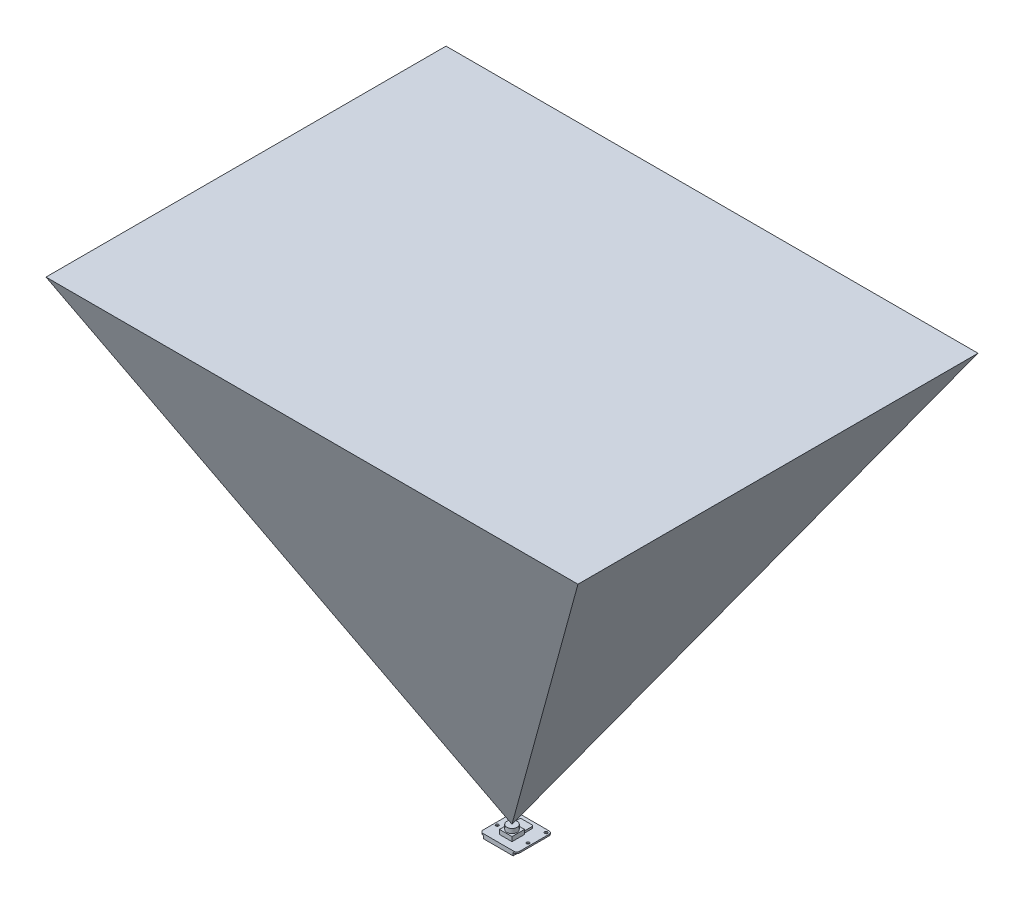
ISO-10303-21;
HEADER;
FILE_DESCRIPTION(('STEP AP214'),'2;1');
FILE_NAME('part.step','',(''),(''),'','','');
FILE_SCHEMA(('AUTOMOTIVE_DESIGN { 1 0 10303 214 1 1 1 1 }'));
ENDSEC;
DATA;
#1=APPLICATION_CONTEXT('core data for automotive mechanical design processes');
#2=APPLICATION_PROTOCOL_DEFINITION('international standard','automotive_design',2000,#1);
#3=PRODUCT_CONTEXT('',#1,'mechanical');
#4=PRODUCT('Part','Part','',(#3));
#5=PRODUCT_RELATED_PRODUCT_CATEGORY('part','',(#4));
#6=PRODUCT_DEFINITION_FORMATION('','',#4);
#7=PRODUCT_DEFINITION_CONTEXT('part definition',#1,'design');
#8=PRODUCT_DEFINITION('design','',#6,#7);
#9=PRODUCT_DEFINITION_SHAPE('','',#8);
#10=(LENGTH_UNIT() NAMED_UNIT(*) SI_UNIT(.MILLI.,.METRE.));
#11=(NAMED_UNIT(*) PLANE_ANGLE_UNIT() SI_UNIT($,.RADIAN.));
#12=(NAMED_UNIT(*) SI_UNIT($,.STERADIAN.) SOLID_ANGLE_UNIT());
#13=UNCERTAINTY_MEASURE_WITH_UNIT(LENGTH_MEASURE(1.E-05),#10,'distance_accuracy_value','');
#14=(GEOMETRIC_REPRESENTATION_CONTEXT(3) GLOBAL_UNCERTAINTY_ASSIGNED_CONTEXT((#13)) GLOBAL_UNIT_ASSIGNED_CONTEXT((#10,
#11,#12)) REPRESENTATION_CONTEXT('',''));
#15=CARTESIAN_POINT('',(0.,0.,0.));
#16=DIRECTION('',(0.,0.,1.));
#17=DIRECTION('',(1.,0.,0.));
#18=AXIS2_PLACEMENT_3D('',#15,#16,#17);
#19=CARTESIAN_POINT('',(193.471570023997,307.,200.));
#20=DIRECTION('',(-0.856267084600329,0.516533328866641,0.));
#21=DIRECTION('',(-0.516533328866641,-0.856267084600329,0.));
#22=AXIS2_PLACEMENT_3D('',#19,#20,#21);
#23=PLANE('',#22);
#24=DIRECTION('',(-0.481487702973172,-0.798171286643521,-0.36206655336201));
#25=VECTOR('',#24,1.);
#26=CARTESIAN_POINT('',(206.226287357831,328.143736552889,136.427259722615));
#27=LINE('',#26,#25);
#28=CARTESIAN_POINT('',(193.471570023997,307.,126.836035449074));
#29=VERTEX_POINT('',#28);
#30=CARTESIAN_POINT('',(12.5,7.,-9.24999999999999));
#31=VERTEX_POINT('',#30);
#32=EDGE_CURVE('E92',#29,#31,#27,.T.);
#33=ORIENTED_EDGE('',*,*,#32,.T.);
#34=DIRECTION('',(0.481487702973172,0.798171286643521,-0.36206655336201));
#35=VECTOR('',#34,1.);
#36=CARTESIAN_POINT('',(133.268934144774,207.200950009044,-100.065178599563));
#37=LINE('',#36,#35);
#38=CARTESIAN_POINT('',(193.471570023997,307.,-145.336035449074));
#39=VERTEX_POINT('',#38);
#40=EDGE_CURVE('E84',#31,#39,#37,.T.);
#41=ORIENTED_EDGE('',*,*,#40,.T.);
#42=DIRECTION('',(0.,0.,-1.));
#43=VECTOR('',#42,1.);
#44=CARTESIAN_POINT('',(193.471570023997,307.,200.));
#45=LINE('',#44,#43);
#46=EDGE_CURVE('E12',#29,#39,#45,.T.);
#47=ORIENTED_EDGE('',*,*,#46,.F.);
#48=EDGE_LOOP('',(#33,#41,#47));
#49=FACE_BOUND('',#48,.T.);
#50=ADVANCED_FACE('F54',(#49),#23,.F.);
#51=CARTESIAN_POINT('',(200.,307.,-145.336035449074));
#52=DIRECTION('',(0.,0.41310442982454,0.910683660806178));
#53=DIRECTION('',(0.,-0.910683660806178,0.41310442982454));
#54=AXIS2_PLACEMENT_3D('',#51,#52,#53);
#55=PLANE('',#54);
#56=ORIENTED_EDGE('',*,*,#40,.F.);
#57=DIRECTION('',(0.481487702973172,-0.798171286643521,0.36206655336201));
#58=VECTOR('',#57,1.);
#59=CARTESIAN_POINT('',(48.9786766065282,-53.4713932719229,18.1810405615259));
#60=LINE('',#59,#58);
#61=CARTESIAN_POINT('',(-168.471570023997,307.,-145.336035449074));
#62=VERTEX_POINT('',#61);
#63=EDGE_CURVE('E88',#62,#31,#60,.T.);
#64=ORIENTED_EDGE('',*,*,#63,.F.);
#65=DIRECTION('',(-1.,0.,0.));
#66=VECTOR('',#65,1.);
#67=CARTESIAN_POINT('',(200.,307.,-145.336035449074));
#68=LINE('',#67,#66);
#69=EDGE_CURVE('E63',#39,#62,#68,.T.);
#70=ORIENTED_EDGE('',*,*,#69,.F.);
#71=EDGE_LOOP('',(#56,#64,#70));
#72=FACE_BOUND('',#71,.T.);
#73=ADVANCED_FACE('F86',(#72),#55,.F.);
#74=CARTESIAN_POINT('',(12.5,7.,200.));
#75=DIRECTION('',(0.856267084600329,0.516533328866641,0.));
#76=DIRECTION('',(-0.516533328866641,0.856267084600329,0.));
#77=AXIS2_PLACEMENT_3D('',#74,#75,#76);
#78=PLANE('',#77);
#79=DIRECTION('',(0.,0.,-1.));
#80=VECTOR('',#79,1.);
#81=CARTESIAN_POINT('',(-168.471570023997,307.,200.));
#82=LINE('',#81,#80);
#83=CARTESIAN_POINT('',(-168.471570023997,307.,126.836035449074));
#84=VERTEX_POINT('',#83);
#85=EDGE_CURVE('E98',#84,#62,#82,.T.);
#86=ORIENTED_EDGE('',*,*,#85,.T.);
#87=ORIENTED_EDGE('',*,*,#63,.T.);
#88=DIRECTION('',(-0.481487702973172,0.798171286643521,0.36206655336201));
#89=VECTOR('',#88,1.);
#90=CARTESIAN_POINT('',(-23.9786766065282,67.4713932719229,18.1810405615259));
#91=LINE('',#90,#89);
#92=EDGE_CURVE('E58',#31,#84,#91,.T.);
#93=ORIENTED_EDGE('',*,*,#92,.T.);
#94=EDGE_LOOP('',(#86,#87,#93));
#95=FACE_BOUND('',#94,.T.);
#96=ADVANCED_FACE('F56',(#95),#78,.F.);
#97=CARTESIAN_POINT('',(200.,7.,-9.25));
#98=DIRECTION('',(0.,0.41310442982454,-0.910683660806178));
#99=DIRECTION('',(0.,0.910683660806178,0.41310442982454));
#100=AXIS2_PLACEMENT_3D('',#97,#98,#99);
#101=PLANE('',#100);
#102=ORIENTED_EDGE('',*,*,#32,.F.);
#103=DIRECTION('',(-1.,0.,0.));
#104=VECTOR('',#103,1.);
#105=CARTESIAN_POINT('',(200.,307.,126.836035449074));
#106=LINE('',#105,#104);
#107=EDGE_CURVE('E77',#29,#84,#106,.T.);
#108=ORIENTED_EDGE('',*,*,#107,.T.);
#109=ORIENTED_EDGE('',*,*,#92,.F.);
#110=EDGE_LOOP('',(#102,#108,#109));
#111=FACE_BOUND('',#110,.T.);
#112=ADVANCED_FACE('F100',(#111),#101,.F.);
#113=CARTESIAN_POINT('',(-168.471570023997,307.,200.));
#114=DIRECTION('',(0.,-1.,0.));
#115=DIRECTION('',(0.,0.,-1.));
#116=AXIS2_PLACEMENT_3D('',#113,#114,#115);
#117=PLANE('',#116);
#118=ORIENTED_EDGE('',*,*,#107,.F.);
#119=ORIENTED_EDGE('',*,*,#46,.T.);
#120=ORIENTED_EDGE('',*,*,#69,.T.);
#121=ORIENTED_EDGE('',*,*,#85,.F.);
#122=EDGE_LOOP('',(#118,#119,#120,#121));
#123=FACE_BOUND('',#122,.T.);
#124=ADVANCED_FACE('F104',(#123),#117,.F.);
#125=CLOSED_SHELL('',(#50,#73,#96,#112,#124));
#126=MANIFOLD_SOLID_BREP('B2_NOT_SHOWN',#125);
#127=CARTESIAN_POINT('',(0.,1.,0.));
#128=DIRECTION('',(0.,-1.,0.));
#129=DIRECTION('',(0.,0.,-1.));
#130=AXIS2_PLACEMENT_3D('',#127,#128,#129);
#131=PLANE('',#130);
#132=DIRECTION('',(1.,0.,0.));
#133=VECTOR('',#132,1.);
#134=CARTESIAN_POINT('',(0.,1.,0.));
#135=LINE('',#134,#133);
#136=CARTESIAN_POINT('',(2.,1.,0.));
#137=VERTEX_POINT('',#136);
#138=CARTESIAN_POINT('',(23.,1.,0.));
#139=VERTEX_POINT('',#138);
#140=EDGE_CURVE('E469',#137,#139,#135,.T.);
#141=ORIENTED_EDGE('',*,*,#140,.T.);
#142=CARTESIAN_POINT('',(23.,1.,-2.));
#143=DIRECTION('',(0.,-1.,0.));
#144=DIRECTION('',(0.,0.,-1.));
#145=AXIS2_PLACEMENT_3D('',#142,#143,#144);
#146=CIRCLE('',#145,2.);
#147=CARTESIAN_POINT('',(25.,1.,-2.));
#148=VERTEX_POINT('',#147);
#149=EDGE_CURVE('E543',#139,#148,#146,.F.);
#150=ORIENTED_EDGE('',*,*,#149,.T.);
#151=DIRECTION('',(0.,0.,-1.));
#152=VECTOR('',#151,1.);
#153=CARTESIAN_POINT('',(25.,1.,0.));
#154=LINE('',#153,#152);
#155=CARTESIAN_POINT('',(25.,1.,-22.));
#156=VERTEX_POINT('',#155);
#157=EDGE_CURVE('E474',#148,#156,#154,.T.);
#158=ORIENTED_EDGE('',*,*,#157,.T.);
#159=CARTESIAN_POINT('',(23.,1.,-22.));
#160=DIRECTION('',(0.,-1.,0.));
#161=DIRECTION('',(0.,0.,-1.));
#162=AXIS2_PLACEMENT_3D('',#159,#160,#161);
#163=CIRCLE('',#162,2.);
#164=CARTESIAN_POINT('',(23.,1.,-24.));
#165=VERTEX_POINT('',#164);
#166=EDGE_CURVE('E537',#156,#165,#163,.F.);
#167=ORIENTED_EDGE('',*,*,#166,.T.);
#168=DIRECTION('',(-1.,0.,0.));
#169=VECTOR('',#168,1.);
#170=CARTESIAN_POINT('',(0.,1.,-24.));
#171=LINE('',#170,#169);
#172=CARTESIAN_POINT('',(2.,1.,-24.));
#173=VERTEX_POINT('',#172);
#174=EDGE_CURVE('E417',#165,#173,#171,.T.);
#175=ORIENTED_EDGE('',*,*,#174,.T.);
#176=CARTESIAN_POINT('',(2.,1.,-22.));
#177=DIRECTION('',(0.,-1.,0.));
#178=DIRECTION('',(0.,0.,-1.));
#179=AXIS2_PLACEMENT_3D('',#176,#177,#178);
#180=CIRCLE('',#179,2.);
#181=CARTESIAN_POINT('',(0.,1.,-22.));
#182=VERTEX_POINT('',#181);
#183=EDGE_CURVE('E534',#173,#182,#180,.F.);
#184=ORIENTED_EDGE('',*,*,#183,.T.);
#185=DIRECTION('',(0.,0.,1.));
#186=VECTOR('',#185,1.);
#187=CARTESIAN_POINT('',(0.,1.,0.));
#188=LINE('',#187,#186);
#189=CARTESIAN_POINT('',(0.,1.,-2.));
#190=VERTEX_POINT('',#189);
#191=EDGE_CURVE('E465',#182,#190,#188,.T.);
#192=ORIENTED_EDGE('',*,*,#191,.T.);
#193=CARTESIAN_POINT('',(2.,1.,-2.));
#194=DIRECTION('',(0.,-1.,0.));
#195=DIRECTION('',(0.,0.,-1.));
#196=AXIS2_PLACEMENT_3D('',#193,#194,#195);
#197=CIRCLE('',#196,2.);
#198=EDGE_CURVE('E540',#190,#137,#197,.F.);
#199=ORIENTED_EDGE('',*,*,#198,.T.);
#200=EDGE_LOOP('',(#141,#150,#158,#167,#175,#184,#192,#199));
#201=FACE_BOUND('',#200,.T.);
#202=CARTESIAN_POINT('',(2.,1.,-9.7));
#203=DIRECTION('',(0.,1.,0.));
#204=DIRECTION('',(0.,0.,1.));
#205=AXIS2_PLACEMENT_3D('',#202,#203,#204);
#206=CIRCLE('',#205,1.);
#207=CARTESIAN_POINT('',(2.,1.,-8.7));
#208=VERTEX_POINT('',#207);
#209=EDGE_CURVE('E361',#208,#208,#206,.T.);
#210=ORIENTED_EDGE('',*,*,#209,.F.);
#211=EDGE_LOOP('',(#210));
#212=FACE_BOUND('',#211,.T.);
#213=CARTESIAN_POINT('',(2.,1.,-22.));
#214=DIRECTION('',(0.,1.,0.));
#215=DIRECTION('',(0.,0.,1.));
#216=AXIS2_PLACEMENT_3D('',#213,#214,#215);
#217=CIRCLE('',#216,1.);
#218=CARTESIAN_POINT('',(2.,1.,-21.));
#219=VERTEX_POINT('',#218);
#220=EDGE_CURVE('E357',#219,#219,#217,.T.);
#221=ORIENTED_EDGE('',*,*,#220,.F.);
#222=EDGE_LOOP('',(#221));
#223=FACE_BOUND('',#222,.T.);
#224=CARTESIAN_POINT('',(23.,1.,-22.));
#225=DIRECTION('',(0.,1.,0.));
#226=DIRECTION('',(0.,0.,1.));
#227=AXIS2_PLACEMENT_3D('',#224,#225,#226);
#228=CIRCLE('',#227,1.);
#229=CARTESIAN_POINT('',(23.,1.,-21.));
#230=VERTEX_POINT('',#229);
#231=EDGE_CURVE('E352',#230,#230,#228,.T.);
#232=ORIENTED_EDGE('',*,*,#231,.F.);
#233=EDGE_LOOP('',(#232));
#234=FACE_BOUND('',#233,.T.);
#235=CARTESIAN_POINT('',(23.,1.,-9.7));
#236=DIRECTION('',(0.,1.,0.));
#237=DIRECTION('',(0.,0.,1.));
#238=AXIS2_PLACEMENT_3D('',#235,#236,#237);
#239=CIRCLE('',#238,1.);
#240=CARTESIAN_POINT('',(23.,1.,-8.7));
#241=VERTEX_POINT('',#240);
#242=EDGE_CURVE('E346',#241,#241,#239,.T.);
#243=ORIENTED_EDGE('',*,*,#242,.F.);
#244=EDGE_LOOP('',(#243));
#245=FACE_BOUND('',#244,.T.);
#246=DIRECTION('',(0.,0.,1.));
#247=VECTOR('',#246,1.);
#248=CARTESIAN_POINT('',(9.075,1.,-16.55));
#249=LINE('',#248,#247);
#250=CARTESIAN_POINT('',(9.075,1.,-15.55));
#251=VERTEX_POINT('',#250);
#252=CARTESIAN_POINT('',(9.075,1.,-13.5));
#253=VERTEX_POINT('',#252);
#254=EDGE_CURVE('E339',#251,#253,#249,.T.);
#255=ORIENTED_EDGE('',*,*,#254,.F.);
#256=CARTESIAN_POINT('',(8.075,1.,-15.55));
#257=DIRECTION('',(0.,-1.,0.));
#258=DIRECTION('',(0.,0.,-1.));
#259=AXIS2_PLACEMENT_3D('',#256,#257,#258);
#260=CIRCLE('',#259,1.);
#261=CARTESIAN_POINT('',(8.075,1.,-16.55));
#262=VERTEX_POINT('',#261);
#263=EDGE_CURVE('E564',#251,#262,#260,.F.);
#264=ORIENTED_EDGE('',*,*,#263,.T.);
#265=CARTESIAN_POINT('',(8.075,1.,-17.55));
#266=DIRECTION('',(0.,-1.,0.));
#267=DIRECTION('',(0.,0.,-1.));
#268=AXIS2_PLACEMENT_3D('',#265,#266,#267);
#269=CIRCLE('',#268,1.);
#270=CARTESIAN_POINT('',(7.075,1.,-17.55));
#271=VERTEX_POINT('',#270);
#272=EDGE_CURVE('E593',#262,#271,#269,.T.);
#273=ORIENTED_EDGE('',*,*,#272,.T.);
#274=DIRECTION('',(0.,0.,1.));
#275=VECTOR('',#274,1.);
#276=CARTESIAN_POINT('',(7.075,1.,-20.45));
#277=LINE('',#276,#275);
#278=CARTESIAN_POINT('',(7.075,1.,-19.45));
#279=VERTEX_POINT('',#278);
#280=EDGE_CURVE('E619',#279,#271,#277,.T.);
#281=ORIENTED_EDGE('',*,*,#280,.F.);
#282=CARTESIAN_POINT('',(8.075,1.,-19.45));
#283=DIRECTION('',(0.,-1.,0.));
#284=DIRECTION('',(0.,0.,-1.));
#285=AXIS2_PLACEMENT_3D('',#282,#283,#284);
#286=CIRCLE('',#285,1.);
#287=CARTESIAN_POINT('',(8.075,1.,-20.45));
#288=VERTEX_POINT('',#287);
#289=EDGE_CURVE('E52',#279,#288,#286,.T.);
#290=ORIENTED_EDGE('',*,*,#289,.T.);
#291=DIRECTION('',(-1.,0.,0.));
#292=VECTOR('',#291,1.);
#293=CARTESIAN_POINT('',(15.925,1.,-20.45));
#294=LINE('',#293,#292);
#295=CARTESIAN_POINT('',(14.925,1.,-20.45));
#296=VERTEX_POINT('',#295);
#297=EDGE_CURVE('E601',#296,#288,#294,.T.);
#298=ORIENTED_EDGE('',*,*,#297,.F.);
#299=CARTESIAN_POINT('',(14.925,1.,-19.45));
#300=DIRECTION('',(0.,-1.,0.));
#301=DIRECTION('',(0.,0.,-1.));
#302=AXIS2_PLACEMENT_3D('',#299,#300,#301);
#303=CIRCLE('',#302,1.);
#304=CARTESIAN_POINT('',(15.925,1.,-19.45));
#305=VERTEX_POINT('',#304);
#306=EDGE_CURVE('E157',#296,#305,#303,.T.);
#307=ORIENTED_EDGE('',*,*,#306,.T.);
#308=DIRECTION('',(0.,0.,-1.));
#309=VECTOR('',#308,1.);
#310=CARTESIAN_POINT('',(15.925,1.,-13.5));
#311=LINE('',#310,#309);
#312=CARTESIAN_POINT('',(15.925,1.,-13.5));
#313=VERTEX_POINT('',#312);
#314=EDGE_CURVE('E600',#313,#305,#311,.T.);
#315=ORIENTED_EDGE('',*,*,#314,.F.);
#316=DIRECTION('',(-1.,0.,0.));
#317=VECTOR('',#316,1.);
#318=CARTESIAN_POINT('',(8.25,1.,-13.5));
#319=LINE('',#318,#317);
#320=CARTESIAN_POINT('',(16.75,1.,-13.5));
#321=VERTEX_POINT('',#320);
#322=EDGE_CURVE('E344',#321,#313,#319,.T.);
#323=ORIENTED_EDGE('',*,*,#322,.F.);
#324=DIRECTION('',(0.,0.,-1.));
#325=VECTOR('',#324,1.);
#326=CARTESIAN_POINT('',(16.75,1.,-13.5));
#327=LINE('',#326,#325);
#328=CARTESIAN_POINT('',(16.75,1.,-5.));
#329=VERTEX_POINT('',#328);
#330=EDGE_CURVE('E443',#329,#321,#327,.T.);
#331=ORIENTED_EDGE('',*,*,#330,.F.);
#332=DIRECTION('',(1.,0.,0.));
#333=VECTOR('',#332,1.);
#334=CARTESIAN_POINT('',(8.25,1.,-5.));
#335=LINE('',#334,#333);
#336=CARTESIAN_POINT('',(8.25,1.,-5.));
#337=VERTEX_POINT('',#336);
#338=EDGE_CURVE('E439',#337,#329,#335,.T.);
#339=ORIENTED_EDGE('',*,*,#338,.F.);
#340=DIRECTION('',(0.,0.,1.));
#341=VECTOR('',#340,1.);
#342=CARTESIAN_POINT('',(8.25,1.,-13.5));
#343=LINE('',#342,#341);
#344=CARTESIAN_POINT('',(8.25,1.,-13.5));
#345=VERTEX_POINT('',#344);
#346=EDGE_CURVE('E421',#345,#337,#343,.T.);
#347=ORIENTED_EDGE('',*,*,#346,.F.);
#348=EDGE_CURVE('E447',#253,#345,#319,.T.);
#349=ORIENTED_EDGE('',*,*,#348,.F.);
#350=EDGE_LOOP('',(#255,#264,#273,#281,#290,#298,#307,#315,#323,#331,#339,#347,#349));
#351=FACE_BOUND('',#350,.T.);
#352=ADVANCED_FACE('F147',(#201,#212,#223,#234,#245,#351),#131,.F.);
#353=CARTESIAN_POINT('',(8.25,4.,-13.5));
#354=DIRECTION('',(0.,0.,1.));
#355=DIRECTION('',(1.,0.,0.));
#356=AXIS2_PLACEMENT_3D('',#353,#354,#355);
#357=PLANE('',#356);
#358=DIRECTION('',(0.,-1.,0.));
#359=VECTOR('',#358,1.);
#360=CARTESIAN_POINT('',(15.925,2.3,-13.5));
#361=LINE('',#360,#359);
#362=CARTESIAN_POINT('',(15.925,2.3,-13.5));
#363=VERTEX_POINT('',#362);
#364=EDGE_CURVE('E322',#363,#313,#361,.T.);
#365=ORIENTED_EDGE('',*,*,#364,.F.);
#366=DIRECTION('',(1.,0.,0.));
#367=VECTOR('',#366,1.);
#368=CARTESIAN_POINT('',(9.075,2.3,-13.5));
#369=LINE('',#368,#367);
#370=CARTESIAN_POINT('',(9.075,2.3,-13.5));
#371=VERTEX_POINT('',#370);
#372=EDGE_CURVE('E329',#371,#363,#369,.T.);
#373=ORIENTED_EDGE('',*,*,#372,.F.);
#374=DIRECTION('',(0.,-1.,0.));
#375=VECTOR('',#374,1.);
#376=CARTESIAN_POINT('',(9.075,2.3,-13.5));
#377=LINE('',#376,#375);
#378=EDGE_CURVE('E347',#371,#253,#377,.T.);
#379=ORIENTED_EDGE('',*,*,#378,.T.);
#380=ORIENTED_EDGE('',*,*,#348,.T.);
#381=DIRECTION('',(0.,-1.,0.));
#382=VECTOR('',#381,1.);
#383=CARTESIAN_POINT('',(8.25,4.,-13.5));
#384=LINE('',#383,#382);
#385=CARTESIAN_POINT('',(8.25,4.,-13.5));
#386=VERTEX_POINT('',#385);
#387=EDGE_CURVE('E435',#386,#345,#384,.T.);
#388=ORIENTED_EDGE('',*,*,#387,.F.);
#389=DIRECTION('',(-1.,0.,0.));
#390=VECTOR('',#389,1.);
#391=CARTESIAN_POINT('',(8.25,4.,-13.5));
#392=LINE('',#391,#390);
#393=CARTESIAN_POINT('',(16.75,4.,-13.5));
#394=VERTEX_POINT('',#393);
#395=EDGE_CURVE('E432',#394,#386,#392,.T.);
#396=ORIENTED_EDGE('',*,*,#395,.F.);
#397=DIRECTION('',(0.,-1.,0.));
#398=VECTOR('',#397,1.);
#399=CARTESIAN_POINT('',(16.75,4.,-13.5));
#400=LINE('',#399,#398);
#401=EDGE_CURVE('E453',#394,#321,#400,.T.);
#402=ORIENTED_EDGE('',*,*,#401,.T.);
#403=ORIENTED_EDGE('',*,*,#322,.T.);
#404=EDGE_LOOP('',(#365,#373,#379,#380,#388,#396,#402,#403));
#405=FACE_BOUND('',#404,.T.);
#406=ADVANCED_FACE('F342',(#405),#357,.F.);
#407=CARTESIAN_POINT('',(0.,1.,0.));
#408=DIRECTION('',(1.,0.,0.));
#409=DIRECTION('',(0.,0.,-1.));
#410=AXIS2_PLACEMENT_3D('',#407,#408,#409);
#411=PLANE('',#410);
#412=DIRECTION('',(0.,0.,1.));
#413=VECTOR('',#412,1.);
#414=CARTESIAN_POINT('',(0.,0.,0.));
#415=LINE('',#414,#413);
#416=CARTESIAN_POINT('',(0.,0.,-22.));
#417=VERTEX_POINT('',#416);
#418=CARTESIAN_POINT('',(0.,0.,-2.));
#419=VERTEX_POINT('',#418);
#420=EDGE_CURVE('E464',#417,#419,#415,.T.);
#421=ORIENTED_EDGE('',*,*,#420,.T.);
#422=DIRECTION('',(0.,-1.,0.));
#423=VECTOR('',#422,1.);
#424=CARTESIAN_POINT('',(0.,1.,-2.));
#425=LINE('',#424,#423);
#426=EDGE_CURVE('E550',#419,#190,#425,.F.);
#427=ORIENTED_EDGE('',*,*,#426,.T.);
#428=ORIENTED_EDGE('',*,*,#191,.F.);
#429=DIRECTION('',(0.,-1.,0.));
#430=VECTOR('',#429,1.);
#431=CARTESIAN_POINT('',(0.,1.,-22.));
#432=LINE('',#431,#430);
#433=EDGE_CURVE('E546',#182,#417,#432,.T.);
#434=ORIENTED_EDGE('',*,*,#433,.T.);
#435=EDGE_LOOP('',(#421,#427,#428,#434));
#436=FACE_BOUND('',#435,.T.);
#437=ADVANCED_FACE('F666',(#436),#411,.F.);
#438=CARTESIAN_POINT('',(0.,1.,0.));
#439=DIRECTION('',(0.,0.,-1.));
#440=DIRECTION('',(-1.,0.,0.));
#441=AXIS2_PLACEMENT_3D('',#438,#439,#440);
#442=PLANE('',#441);
#443=DIRECTION('',(1.,0.,0.));
#444=VECTOR('',#443,1.);
#445=CARTESIAN_POINT('',(0.,0.,0.));
#446=LINE('',#445,#444);
#447=CARTESIAN_POINT('',(22.5,0.,0.));
#448=VERTEX_POINT('',#447);
#449=CARTESIAN_POINT('',(23.,0.,0.));
#450=VERTEX_POINT('',#449);
#451=EDGE_CURVE('E484',#448,#450,#446,.T.);
#452=ORIENTED_EDGE('',*,*,#451,.T.);
#453=DIRECTION('',(0.,-1.,0.));
#454=VECTOR('',#453,1.);
#455=CARTESIAN_POINT('',(23.,1.,0.));
#456=LINE('',#455,#454);
#457=EDGE_CURVE('E531',#450,#139,#456,.F.);
#458=ORIENTED_EDGE('',*,*,#457,.T.);
#459=ORIENTED_EDGE('',*,*,#140,.F.);
#460=DIRECTION('',(0.,-1.,0.));
#461=VECTOR('',#460,1.);
#462=CARTESIAN_POINT('',(2.,1.,0.));
#463=LINE('',#462,#461);
#464=CARTESIAN_POINT('',(2.,0.,0.));
#465=VERTEX_POINT('',#464);
#466=EDGE_CURVE('E527',#137,#465,#463,.T.);
#467=ORIENTED_EDGE('',*,*,#466,.T.);
#468=CARTESIAN_POINT('',(2.5,0.,0.));
#469=VERTEX_POINT('',#468);
#470=EDGE_CURVE('E485',#465,#469,#446,.T.);
#471=ORIENTED_EDGE('',*,*,#470,.T.);
#472=DIRECTION('',(0.,1.,0.));
#473=VECTOR('',#472,1.);
#474=CARTESIAN_POINT('',(2.5,-2.,0.));
#475=LINE('',#474,#473);
#476=CARTESIAN_POINT('',(2.5,-2.,0.));
#477=VERTEX_POINT('',#476);
#478=EDGE_CURVE('E383',#477,#469,#475,.T.);
#479=ORIENTED_EDGE('',*,*,#478,.F.);
#480=DIRECTION('',(-1.,0.,0.));
#481=VECTOR('',#480,1.);
#482=CARTESIAN_POINT('',(2.5,-2.,0.));
#483=LINE('',#482,#481);
#484=CARTESIAN_POINT('',(22.5,-2.,0.));
#485=VERTEX_POINT('',#484);
#486=EDGE_CURVE('E380',#485,#477,#483,.T.);
#487=ORIENTED_EDGE('',*,*,#486,.F.);
#488=DIRECTION('',(0.,1.,0.));
#489=VECTOR('',#488,1.);
#490=CARTESIAN_POINT('',(22.5,-2.,0.));
#491=LINE('',#490,#489);
#492=EDGE_CURVE('E399',#485,#448,#491,.T.);
#493=ORIENTED_EDGE('',*,*,#492,.T.);
#494=EDGE_LOOP('',(#452,#458,#459,#467,#471,#479,#487,#493));
#495=FACE_BOUND('',#494,.T.);
#496=ADVANCED_FACE('F634',(#495),#442,.F.);
#497=CARTESIAN_POINT('',(25.,1.,0.));
#498=DIRECTION('',(-1.,0.,0.));
#499=DIRECTION('',(0.,0.,1.));
#500=AXIS2_PLACEMENT_3D('',#497,#498,#499);
#501=PLANE('',#500);
#502=ORIENTED_EDGE('',*,*,#157,.F.);
#503=DIRECTION('',(0.,-1.,0.));
#504=VECTOR('',#503,1.);
#505=CARTESIAN_POINT('',(25.,1.,-2.));
#506=LINE('',#505,#504);
#507=CARTESIAN_POINT('',(25.,0.,-2.));
#508=VERTEX_POINT('',#507);
#509=EDGE_CURVE('E511',#148,#508,#506,.T.);
#510=ORIENTED_EDGE('',*,*,#509,.T.);
#511=DIRECTION('',(0.,0.,-1.));
#512=VECTOR('',#511,1.);
#513=CARTESIAN_POINT('',(25.,0.,0.));
#514=LINE('',#513,#512);
#515=CARTESIAN_POINT('',(25.,0.,-22.));
#516=VERTEX_POINT('',#515);
#517=EDGE_CURVE('E488',#508,#516,#514,.T.);
#518=ORIENTED_EDGE('',*,*,#517,.T.);
#519=DIRECTION('',(0.,-1.,0.));
#520=VECTOR('',#519,1.);
#521=CARTESIAN_POINT('',(25.,1.,-22.));
#522=LINE('',#521,#520);
#523=EDGE_CURVE('E416',#516,#156,#522,.F.);
#524=ORIENTED_EDGE('',*,*,#523,.T.);
#525=EDGE_LOOP('',(#502,#510,#518,#524));
#526=FACE_BOUND('',#525,.T.);
#527=ADVANCED_FACE('F648',(#526),#501,.F.);
#528=CARTESIAN_POINT('',(0.,1.,-24.));
#529=DIRECTION('',(0.,0.,1.));
#530=DIRECTION('',(1.,0.,0.));
#531=AXIS2_PLACEMENT_3D('',#528,#529,#530);
#532=PLANE('',#531);
#533=ORIENTED_EDGE('',*,*,#174,.F.);
#534=DIRECTION('',(0.,-1.,0.));
#535=VECTOR('',#534,1.);
#536=CARTESIAN_POINT('',(23.,1.,-24.));
#537=LINE('',#536,#535);
#538=CARTESIAN_POINT('',(23.,0.,-24.));
#539=VERTEX_POINT('',#538);
#540=EDGE_CURVE('E556',#165,#539,#537,.T.);
#541=ORIENTED_EDGE('',*,*,#540,.T.);
#542=DIRECTION('',(-1.,0.,0.));
#543=VECTOR('',#542,1.);
#544=CARTESIAN_POINT('',(0.,0.,-24.));
#545=LINE('',#544,#543);
#546=CARTESIAN_POINT('',(2.,0.,-24.));
#547=VERTEX_POINT('',#546);
#548=EDGE_CURVE('E470',#539,#547,#545,.T.);
#549=ORIENTED_EDGE('',*,*,#548,.T.);
#550=DIRECTION('',(0.,-1.,0.));
#551=VECTOR('',#550,1.);
#552=CARTESIAN_POINT('',(2.,1.,-24.));
#553=LINE('',#552,#551);
#554=EDGE_CURVE('E553',#547,#173,#553,.F.);
#555=ORIENTED_EDGE('',*,*,#554,.T.);
#556=EDGE_LOOP('',(#533,#541,#549,#555));
#557=FACE_BOUND('',#556,.T.);
#558=ADVANCED_FACE('F657',(#557),#532,.F.);
#559=CARTESIAN_POINT('',(0.,0.,0.));
#560=DIRECTION('',(0.,-1.,0.));
#561=DIRECTION('',(0.,0.,-1.));
#562=AXIS2_PLACEMENT_3D('',#559,#560,#561);
#563=PLANE('',#562);
#564=CARTESIAN_POINT('',(23.,0.,-9.7));
#565=DIRECTION('',(0.,-1.,0.));
#566=DIRECTION('',(0.,0.,-1.));
#567=AXIS2_PLACEMENT_3D('',#564,#565,#566);
#568=CIRCLE('',#567,1.);
#569=CARTESIAN_POINT('',(23.,0.,-10.7));
#570=VERTEX_POINT('',#569);
#571=EDGE_CURVE('E389',#570,#570,#568,.T.);
#572=ORIENTED_EDGE('',*,*,#571,.F.);
#573=EDGE_LOOP('',(#572));
#574=FACE_BOUND('',#573,.T.);
#575=CARTESIAN_POINT('',(23.,0.,-22.));
#576=DIRECTION('',(0.,-1.,0.));
#577=DIRECTION('',(0.,0.,-1.));
#578=AXIS2_PLACEMENT_3D('',#575,#576,#577);
#579=CIRCLE('',#578,1.);
#580=CARTESIAN_POINT('',(23.,0.,-23.));
#581=VERTEX_POINT('',#580);
#582=EDGE_CURVE('E502',#581,#581,#579,.T.);
#583=ORIENTED_EDGE('',*,*,#582,.F.);
#584=EDGE_LOOP('',(#583));
#585=FACE_BOUND('',#584,.T.);
#586=CARTESIAN_POINT('',(2.,0.,-22.));
#587=DIRECTION('',(0.,-1.,0.));
#588=DIRECTION('',(0.,0.,-1.));
#589=AXIS2_PLACEMENT_3D('',#586,#587,#588);
#590=CIRCLE('',#589,1.);
#591=CARTESIAN_POINT('',(2.,0.,-23.));
#592=VERTEX_POINT('',#591);
#593=EDGE_CURVE('E498',#592,#592,#590,.T.);
#594=ORIENTED_EDGE('',*,*,#593,.F.);
#595=EDGE_LOOP('',(#594));
#596=FACE_BOUND('',#595,.T.);
#597=CARTESIAN_POINT('',(2.,0.,-9.7));
#598=DIRECTION('',(0.,-1.,0.));
#599=DIRECTION('',(0.,0.,-1.));
#600=AXIS2_PLACEMENT_3D('',#597,#598,#599);
#601=CIRCLE('',#600,1.);
#602=CARTESIAN_POINT('',(2.,0.,-10.7));
#603=VERTEX_POINT('',#602);
#604=EDGE_CURVE('E368',#603,#603,#601,.T.);
#605=ORIENTED_EDGE('',*,*,#604,.F.);
#606=EDGE_LOOP('',(#605));
#607=FACE_BOUND('',#606,.T.);
#608=ORIENTED_EDGE('',*,*,#517,.F.);
#609=CARTESIAN_POINT('',(23.,0.,-2.));
#610=DIRECTION('',(0.,-1.,0.));
#611=DIRECTION('',(0.,0.,-1.));
#612=AXIS2_PLACEMENT_3D('',#609,#610,#611);
#613=CIRCLE('',#612,2.);
#614=EDGE_CURVE('E524',#508,#450,#613,.T.);
#615=ORIENTED_EDGE('',*,*,#614,.T.);
#616=ORIENTED_EDGE('',*,*,#451,.F.);
#617=DIRECTION('',(0.,0.,1.));
#618=VECTOR('',#617,1.);
#619=CARTESIAN_POINT('',(22.5,0.,0.));
#620=LINE('',#619,#618);
#621=CARTESIAN_POINT('',(22.5,0.,-5.4));
#622=VERTEX_POINT('',#621);
#623=EDGE_CURVE('E374',#622,#448,#620,.T.);
#624=ORIENTED_EDGE('',*,*,#623,.F.);
#625=DIRECTION('',(1.,0.,0.));
#626=VECTOR('',#625,1.);
#627=CARTESIAN_POINT('',(2.5,0.,-5.4));
#628=LINE('',#627,#626);
#629=CARTESIAN_POINT('',(2.5,0.,-5.4));
#630=VERTEX_POINT('',#629);
#631=EDGE_CURVE('E388',#630,#622,#628,.T.);
#632=ORIENTED_EDGE('',*,*,#631,.F.);
#633=DIRECTION('',(0.,0.,-1.));
#634=VECTOR('',#633,1.);
#635=CARTESIAN_POINT('',(2.5,0.,0.));
#636=LINE('',#635,#634);
#637=EDGE_CURVE('E384',#469,#630,#636,.T.);
#638=ORIENTED_EDGE('',*,*,#637,.F.);
#639=ORIENTED_EDGE('',*,*,#470,.F.);
#640=CARTESIAN_POINT('',(2.,0.,-2.));
#641=DIRECTION('',(0.,-1.,0.));
#642=DIRECTION('',(0.,0.,-1.));
#643=AXIS2_PLACEMENT_3D('',#640,#641,#642);
#644=CIRCLE('',#643,2.);
#645=EDGE_CURVE('E521',#465,#419,#644,.T.);
#646=ORIENTED_EDGE('',*,*,#645,.T.);
#647=ORIENTED_EDGE('',*,*,#420,.F.);
#648=CARTESIAN_POINT('',(2.,0.,-22.));
#649=DIRECTION('',(0.,-1.,0.));
#650=DIRECTION('',(0.,0.,-1.));
#651=AXIS2_PLACEMENT_3D('',#648,#649,#650);
#652=CIRCLE('',#651,2.);
#653=EDGE_CURVE('E515',#417,#547,#652,.T.);
#654=ORIENTED_EDGE('',*,*,#653,.T.);
#655=ORIENTED_EDGE('',*,*,#548,.F.);
#656=CARTESIAN_POINT('',(23.,0.,-22.));
#657=DIRECTION('',(0.,-1.,0.));
#658=DIRECTION('',(0.,0.,-1.));
#659=AXIS2_PLACEMENT_3D('',#656,#657,#658);
#660=CIRCLE('',#659,2.);
#661=EDGE_CURVE('E518',#539,#516,#660,.T.);
#662=ORIENTED_EDGE('',*,*,#661,.T.);
#663=EDGE_LOOP('',(#608,#615,#616,#624,#632,#638,#639,#646,#647,#654,#655,#662));
#664=FACE_BOUND('',#663,.T.);
#665=ADVANCED_FACE('F675',(#574,#585,#596,#607,#664),#563,.T.);
#666=CARTESIAN_POINT('',(8.25,4.,-13.5));
#667=DIRECTION('',(1.,0.,0.));
#668=DIRECTION('',(0.,0.,-1.));
#669=AXIS2_PLACEMENT_3D('',#666,#667,#668);
#670=PLANE('',#669);
#671=ORIENTED_EDGE('',*,*,#346,.T.);
#672=DIRECTION('',(0.,-1.,0.));
#673=VECTOR('',#672,1.);
#674=CARTESIAN_POINT('',(8.25,4.,-5.));
#675=LINE('',#674,#673);
#676=CARTESIAN_POINT('',(8.25,4.,-5.));
#677=VERTEX_POINT('',#676);
#678=EDGE_CURVE('E460',#677,#337,#675,.T.);
#679=ORIENTED_EDGE('',*,*,#678,.F.);
#680=DIRECTION('',(0.,0.,1.));
#681=VECTOR('',#680,1.);
#682=CARTESIAN_POINT('',(8.25,4.,-13.5));
#683=LINE('',#682,#681);
#684=EDGE_CURVE('E422',#386,#677,#683,.T.);
#685=ORIENTED_EDGE('',*,*,#684,.F.);
#686=ORIENTED_EDGE('',*,*,#387,.T.);
#687=EDGE_LOOP('',(#671,#679,#685,#686));
#688=FACE_BOUND('',#687,.T.);
#689=ADVANCED_FACE('F705',(#688),#670,.F.);
#690=CARTESIAN_POINT('',(8.25,4.,-5.));
#691=DIRECTION('',(0.,0.,-1.));
#692=DIRECTION('',(-1.,0.,0.));
#693=AXIS2_PLACEMENT_3D('',#690,#691,#692);
#694=PLANE('',#693);
#695=ORIENTED_EDGE('',*,*,#338,.T.);
#696=DIRECTION('',(0.,-1.,0.));
#697=VECTOR('',#696,1.);
#698=CARTESIAN_POINT('',(16.75,4.,-5.));
#699=LINE('',#698,#697);
#700=CARTESIAN_POINT('',(16.75,4.,-5.));
#701=VERTEX_POINT('',#700);
#702=EDGE_CURVE('E456',#701,#329,#699,.T.);
#703=ORIENTED_EDGE('',*,*,#702,.F.);
#704=DIRECTION('',(1.,0.,0.));
#705=VECTOR('',#704,1.);
#706=CARTESIAN_POINT('',(8.25,4.,-5.));
#707=LINE('',#706,#705);
#708=EDGE_CURVE('E426',#677,#701,#707,.T.);
#709=ORIENTED_EDGE('',*,*,#708,.F.);
#710=ORIENTED_EDGE('',*,*,#678,.T.);
#711=EDGE_LOOP('',(#695,#703,#709,#710));
#712=FACE_BOUND('',#711,.T.);
#713=ADVANCED_FACE('F952',(#712),#694,.F.);
#714=CARTESIAN_POINT('',(16.75,4.,-13.5));
#715=DIRECTION('',(-1.,0.,0.));
#716=DIRECTION('',(0.,0.,1.));
#717=AXIS2_PLACEMENT_3D('',#714,#715,#716);
#718=PLANE('',#717);
#719=ORIENTED_EDGE('',*,*,#330,.T.);
#720=ORIENTED_EDGE('',*,*,#401,.F.);
#721=DIRECTION('',(0.,0.,-1.));
#722=VECTOR('',#721,1.);
#723=CARTESIAN_POINT('',(16.75,4.,-13.5));
#724=LINE('',#723,#722);
#725=EDGE_CURVE('E429',#701,#394,#724,.T.);
#726=ORIENTED_EDGE('',*,*,#725,.F.);
#727=ORIENTED_EDGE('',*,*,#702,.T.);
#728=EDGE_LOOP('',(#719,#720,#726,#727));
#729=FACE_BOUND('',#728,.T.);
#730=ADVANCED_FACE('F943',(#729),#718,.F.);
#731=CARTESIAN_POINT('',(0.,4.,0.));
#732=DIRECTION('',(0.,1.,0.));
#733=DIRECTION('',(0.,0.,1.));
#734=AXIS2_PLACEMENT_3D('',#731,#732,#733);
#735=PLANE('',#734);
#736=CARTESIAN_POINT('',(12.5,4.,-9.25));
#737=DIRECTION('',(0.,1.,0.));
#738=DIRECTION('',(0.,0.,1.));
#739=AXIS2_PLACEMENT_3D('',#736,#737,#738);
#740=CIRCLE('',#739,3.5);
#741=CARTESIAN_POINT('',(12.5,4.,-5.75));
#742=VERTEX_POINT('',#741);
#743=EDGE_CURVE('E412',#742,#742,#740,.T.);
#744=ORIENTED_EDGE('',*,*,#743,.F.);
#745=EDGE_LOOP('',(#744));
#746=FACE_BOUND('',#745,.T.);
#747=ORIENTED_EDGE('',*,*,#684,.T.);
#748=ORIENTED_EDGE('',*,*,#708,.T.);
#749=ORIENTED_EDGE('',*,*,#725,.T.);
#750=ORIENTED_EDGE('',*,*,#395,.T.);
#751=EDGE_LOOP('',(#747,#748,#749,#750));
#752=FACE_BOUND('',#751,.T.);
#753=ADVANCED_FACE('F934',(#746,#752),#735,.T.);
#754=CARTESIAN_POINT('',(12.5,22.8994949366117,-9.25));
#755=DIRECTION('',(0.,-1.,0.));
#756=DIRECTION('',(0.,0.,-1.));
#757=AXIS2_PLACEMENT_3D('',#754,#755,#756);
#758=CYLINDRICAL_SURFACE('',#757,3.5);
#759=CARTESIAN_POINT('',(12.5,7.,-9.25));
#760=DIRECTION('',(0.,-1.,0.));
#761=DIRECTION('',(0.,0.,-1.));
#762=AXIS2_PLACEMENT_3D('',#759,#760,#761);
#763=CIRCLE('',#762,3.5);
#764=CARTESIAN_POINT('',(12.5,7.,-12.75));
#765=VERTEX_POINT('',#764);
#766=EDGE_CURVE('E411',#765,#765,#763,.T.);
#767=ORIENTED_EDGE('',*,*,#766,.T.);
#768=EDGE_LOOP('',(#767));
#769=FACE_BOUND('',#768,.T.);
#770=ORIENTED_EDGE('',*,*,#743,.T.);
#771=EDGE_LOOP('',(#770));
#772=FACE_BOUND('',#771,.T.);
#773=ADVANCED_FACE('F925',(#769,#772),#758,.T.);
#774=CARTESIAN_POINT('',(0.,7.,0.));
#775=DIRECTION('',(0.,-1.,0.));
#776=DIRECTION('',(0.,0.,-1.));
#777=AXIS2_PLACEMENT_3D('',#774,#775,#776);
#778=PLANE('',#777);
#779=ORIENTED_EDGE('',*,*,#766,.F.);
#780=EDGE_LOOP('',(#779));
#781=FACE_BOUND('',#780,.T.);
#782=ADVANCED_FACE('F695',(#781),#778,.F.);
#783=CARTESIAN_POINT('',(2.5,-2.,0.));
#784=DIRECTION('',(1.,0.,0.));
#785=DIRECTION('',(0.,0.,-1.));
#786=AXIS2_PLACEMENT_3D('',#783,#784,#785);
#787=PLANE('',#786);
#788=ORIENTED_EDGE('',*,*,#637,.T.);
#789=DIRECTION('',(0.,1.,0.));
#790=VECTOR('',#789,1.);
#791=CARTESIAN_POINT('',(2.5,-2.,-5.4));
#792=LINE('',#791,#790);
#793=CARTESIAN_POINT('',(2.5,-2.,-5.4));
#794=VERTEX_POINT('',#793);
#795=EDGE_CURVE('E407',#794,#630,#792,.T.);
#796=ORIENTED_EDGE('',*,*,#795,.F.);
#797=DIRECTION('',(0.,0.,-1.));
#798=VECTOR('',#797,1.);
#799=CARTESIAN_POINT('',(2.5,-2.,0.));
#800=LINE('',#799,#798);
#801=EDGE_CURVE('E369',#477,#794,#800,.T.);
#802=ORIENTED_EDGE('',*,*,#801,.F.);
#803=ORIENTED_EDGE('',*,*,#478,.T.);
#804=EDGE_LOOP('',(#788,#796,#802,#803));
#805=FACE_BOUND('',#804,.T.);
#806=ADVANCED_FACE('F679',(#805),#787,.F.);
#807=CARTESIAN_POINT('',(2.5,-2.,-5.4));
#808=DIRECTION('',(0.,0.,1.));
#809=DIRECTION('',(1.,0.,0.));
#810=AXIS2_PLACEMENT_3D('',#807,#808,#809);
#811=PLANE('',#810);
#812=ORIENTED_EDGE('',*,*,#631,.T.);
#813=DIRECTION('',(0.,1.,0.));
#814=VECTOR('',#813,1.);
#815=CARTESIAN_POINT('',(22.5,-2.,-5.4));
#816=LINE('',#815,#814);
#817=CARTESIAN_POINT('',(22.5,-2.,-5.4));
#818=VERTEX_POINT('',#817);
#819=EDGE_CURVE('E403',#818,#622,#816,.T.);
#820=ORIENTED_EDGE('',*,*,#819,.F.);
#821=DIRECTION('',(1.,0.,0.));
#822=VECTOR('',#821,1.);
#823=CARTESIAN_POINT('',(2.5,-2.,-5.4));
#824=LINE('',#823,#822);
#825=EDGE_CURVE('E373',#794,#818,#824,.T.);
#826=ORIENTED_EDGE('',*,*,#825,.F.);
#827=ORIENTED_EDGE('',*,*,#795,.T.);
#828=EDGE_LOOP('',(#812,#820,#826,#827));
#829=FACE_BOUND('',#828,.T.);
#830=ADVANCED_FACE('F687',(#829),#811,.F.);
#831=CARTESIAN_POINT('',(22.5,-2.,0.));
#832=DIRECTION('',(-1.,0.,0.));
#833=DIRECTION('',(0.,0.,1.));
#834=AXIS2_PLACEMENT_3D('',#831,#832,#833);
#835=PLANE('',#834);
#836=ORIENTED_EDGE('',*,*,#623,.T.);
#837=ORIENTED_EDGE('',*,*,#492,.F.);
#838=DIRECTION('',(0.,0.,1.));
#839=VECTOR('',#838,1.);
#840=CARTESIAN_POINT('',(22.5,-2.,0.));
#841=LINE('',#840,#839);
#842=EDGE_CURVE('E377',#818,#485,#841,.T.);
#843=ORIENTED_EDGE('',*,*,#842,.F.);
#844=ORIENTED_EDGE('',*,*,#819,.T.);
#845=EDGE_LOOP('',(#836,#837,#843,#844));
#846=FACE_BOUND('',#845,.T.);
#847=ADVANCED_FACE('F685',(#846),#835,.F.);
#848=CARTESIAN_POINT('',(0.,-2.,0.));
#849=DIRECTION('',(0.,-1.,0.));
#850=DIRECTION('',(0.,0.,-1.));
#851=AXIS2_PLACEMENT_3D('',#848,#849,#850);
#852=PLANE('',#851);
#853=ORIENTED_EDGE('',*,*,#801,.T.);
#854=ORIENTED_EDGE('',*,*,#825,.T.);
#855=ORIENTED_EDGE('',*,*,#842,.T.);
#856=ORIENTED_EDGE('',*,*,#486,.T.);
#857=EDGE_LOOP('',(#853,#854,#855,#856));
#858=FACE_BOUND('',#857,.T.);
#859=ADVANCED_FACE('F681',(#858),#852,.T.);
#860=CARTESIAN_POINT('',(2.,-2.,-9.7));
#861=DIRECTION('',(0.,1.,0.));
#862=DIRECTION('',(0.,0.,1.));
#863=AXIS2_PLACEMENT_3D('',#860,#861,#862);
#864=CYLINDRICAL_SURFACE('',#863,1.);
#865=ORIENTED_EDGE('',*,*,#604,.T.);
#866=EDGE_LOOP('',(#865));
#867=FACE_BOUND('',#866,.T.);
#868=ORIENTED_EDGE('',*,*,#209,.T.);
#869=EDGE_LOOP('',(#868));
#870=FACE_BOUND('',#869,.T.);
#871=ADVANCED_FACE('F767',(#867,#870),#864,.F.);
#872=CARTESIAN_POINT('',(2.,-2.,-22.));
#873=DIRECTION('',(0.,1.,0.));
#874=DIRECTION('',(0.,0.,1.));
#875=AXIS2_PLACEMENT_3D('',#872,#873,#874);
#876=CYLINDRICAL_SURFACE('',#875,1.);
#877=ORIENTED_EDGE('',*,*,#593,.T.);
#878=EDGE_LOOP('',(#877));
#879=FACE_BOUND('',#878,.T.);
#880=ORIENTED_EDGE('',*,*,#220,.T.);
#881=EDGE_LOOP('',(#880));
#882=FACE_BOUND('',#881,.T.);
#883=ADVANCED_FACE('F763',(#879,#882),#876,.F.);
#884=CARTESIAN_POINT('',(23.,-2.,-22.));
#885=DIRECTION('',(0.,1.,0.));
#886=DIRECTION('',(0.,0.,1.));
#887=AXIS2_PLACEMENT_3D('',#884,#885,#886);
#888=CYLINDRICAL_SURFACE('',#887,1.);
#889=ORIENTED_EDGE('',*,*,#582,.T.);
#890=EDGE_LOOP('',(#889));
#891=FACE_BOUND('',#890,.T.);
#892=ORIENTED_EDGE('',*,*,#231,.T.);
#893=EDGE_LOOP('',(#892));
#894=FACE_BOUND('',#893,.T.);
#895=ADVANCED_FACE('F766',(#891,#894),#888,.F.);
#896=CARTESIAN_POINT('',(23.,-2.,-9.7));
#897=DIRECTION('',(0.,1.,0.));
#898=DIRECTION('',(0.,0.,1.));
#899=AXIS2_PLACEMENT_3D('',#896,#897,#898);
#900=CYLINDRICAL_SURFACE('',#899,1.);
#901=ORIENTED_EDGE('',*,*,#571,.T.);
#902=EDGE_LOOP('',(#901));
#903=FACE_BOUND('',#902,.T.);
#904=ORIENTED_EDGE('',*,*,#242,.T.);
#905=EDGE_LOOP('',(#904));
#906=FACE_BOUND('',#905,.T.);
#907=ADVANCED_FACE('F720',(#903,#906),#900,.F.);
#908=CARTESIAN_POINT('',(23.,1.,-2.));
#909=DIRECTION('',(0.,-1.,0.));
#910=DIRECTION('',(0.,0.,-1.));
#911=AXIS2_PLACEMENT_3D('',#908,#909,#910);
#912=CYLINDRICAL_SURFACE('',#911,2.);
#913=ORIENTED_EDGE('',*,*,#149,.F.);
#914=ORIENTED_EDGE('',*,*,#457,.F.);
#915=ORIENTED_EDGE('',*,*,#614,.F.);
#916=ORIENTED_EDGE('',*,*,#509,.F.);
#917=EDGE_LOOP('',(#913,#914,#915,#916));
#918=FACE_BOUND('',#917,.T.);
#919=ADVANCED_FACE('F641',(#918),#912,.T.);
#920=CARTESIAN_POINT('',(2.,1.,-2.));
#921=DIRECTION('',(0.,-1.,0.));
#922=DIRECTION('',(0.,0.,-1.));
#923=AXIS2_PLACEMENT_3D('',#920,#921,#922);
#924=CYLINDRICAL_SURFACE('',#923,2.);
#925=ORIENTED_EDGE('',*,*,#198,.F.);
#926=ORIENTED_EDGE('',*,*,#426,.F.);
#927=ORIENTED_EDGE('',*,*,#645,.F.);
#928=ORIENTED_EDGE('',*,*,#466,.F.);
#929=EDGE_LOOP('',(#925,#926,#927,#928));
#930=FACE_BOUND('',#929,.T.);
#931=ADVANCED_FACE('F670',(#930),#924,.T.);
#932=CARTESIAN_POINT('',(23.,1.,-22.));
#933=DIRECTION('',(0.,-1.,0.));
#934=DIRECTION('',(0.,0.,-1.));
#935=AXIS2_PLACEMENT_3D('',#932,#933,#934);
#936=CYLINDRICAL_SURFACE('',#935,2.);
#937=ORIENTED_EDGE('',*,*,#166,.F.);
#938=ORIENTED_EDGE('',*,*,#523,.F.);
#939=ORIENTED_EDGE('',*,*,#661,.F.);
#940=ORIENTED_EDGE('',*,*,#540,.F.);
#941=EDGE_LOOP('',(#937,#938,#939,#940));
#942=FACE_BOUND('',#941,.T.);
#943=ADVANCED_FACE('F652',(#942),#936,.T.);
#944=CARTESIAN_POINT('',(2.,1.,-22.));
#945=DIRECTION('',(0.,-1.,0.));
#946=DIRECTION('',(0.,0.,-1.));
#947=AXIS2_PLACEMENT_3D('',#944,#945,#946);
#948=CYLINDRICAL_SURFACE('',#947,2.);
#949=ORIENTED_EDGE('',*,*,#183,.F.);
#950=ORIENTED_EDGE('',*,*,#554,.F.);
#951=ORIENTED_EDGE('',*,*,#653,.F.);
#952=ORIENTED_EDGE('',*,*,#433,.F.);
#953=EDGE_LOOP('',(#949,#950,#951,#952));
#954=FACE_BOUND('',#953,.T.);
#955=ADVANCED_FACE('F661',(#954),#948,.T.);
#956=CARTESIAN_POINT('',(15.925,2.3,-13.5));
#957=DIRECTION('',(-1.,0.,0.));
#958=DIRECTION('',(0.,0.,1.));
#959=AXIS2_PLACEMENT_3D('',#956,#957,#958);
#960=PLANE('',#959);
#961=ORIENTED_EDGE('',*,*,#314,.T.);
#962=DIRECTION('',(0.,-1.,0.));
#963=VECTOR('',#962,1.);
#964=CARTESIAN_POINT('',(15.925,2.3,-19.45));
#965=LINE('',#964,#963);
#966=CARTESIAN_POINT('',(15.925,2.3,-19.45));
#967=VERTEX_POINT('',#966);
#968=EDGE_CURVE('E325',#305,#967,#965,.F.);
#969=ORIENTED_EDGE('',*,*,#968,.T.);
#970=DIRECTION('',(0.,0.,-1.));
#971=VECTOR('',#970,1.);
#972=CARTESIAN_POINT('',(15.925,2.3,-13.5));
#973=LINE('',#972,#971);
#974=EDGE_CURVE('E317',#363,#967,#973,.T.);
#975=ORIENTED_EDGE('',*,*,#974,.F.);
#976=ORIENTED_EDGE('',*,*,#364,.T.);
#977=EDGE_LOOP('',(#961,#969,#975,#976));
#978=FACE_BOUND('',#977,.T.);
#979=ADVANCED_FACE('F320',(#978),#960,.F.);
#980=CARTESIAN_POINT('',(15.925,2.3,-20.45));
#981=DIRECTION('',(0.,0.,1.));
#982=DIRECTION('',(1.,0.,0.));
#983=AXIS2_PLACEMENT_3D('',#980,#981,#982);
#984=PLANE('',#983);
#985=DIRECTION('',(-1.,0.,0.));
#986=VECTOR('',#985,1.);
#987=CARTESIAN_POINT('',(15.925,2.3,-20.45));
#988=LINE('',#987,#986);
#989=CARTESIAN_POINT('',(14.925,2.3,-20.45));
#990=VERTEX_POINT('',#989);
#991=CARTESIAN_POINT('',(8.075,2.3,-20.45));
#992=VERTEX_POINT('',#991);
#993=EDGE_CURVE('E328',#990,#992,#988,.T.);
#994=ORIENTED_EDGE('',*,*,#993,.F.);
#995=DIRECTION('',(0.,-1.,0.));
#996=VECTOR('',#995,1.);
#997=CARTESIAN_POINT('',(14.925,2.3,-20.45));
#998=LINE('',#997,#996);
#999=EDGE_CURVE('E584',#990,#296,#998,.T.);
#1000=ORIENTED_EDGE('',*,*,#999,.T.);
#1001=ORIENTED_EDGE('',*,*,#297,.T.);
#1002=DIRECTION('',(0.,-1.,0.));
#1003=VECTOR('',#1002,1.);
#1004=CARTESIAN_POINT('',(8.075,2.3,-20.45));
#1005=LINE('',#1004,#1003);
#1006=EDGE_CURVE('E172',#288,#992,#1005,.F.);
#1007=ORIENTED_EDGE('',*,*,#1006,.T.);
#1008=EDGE_LOOP('',(#994,#1000,#1001,#1007));
#1009=FACE_BOUND('',#1008,.T.);
#1010=ADVANCED_FACE('F608',(#1009),#984,.F.);
#1011=CARTESIAN_POINT('',(7.075,2.3,-20.45));
#1012=DIRECTION('',(1.,0.,0.));
#1013=DIRECTION('',(0.,0.,-1.));
#1014=AXIS2_PLACEMENT_3D('',#1011,#1012,#1013);
#1015=PLANE('',#1014);
#1016=ORIENTED_EDGE('',*,*,#280,.T.);
#1017=DIRECTION('',(0.,-1.,0.));
#1018=VECTOR('',#1017,1.);
#1019=CARTESIAN_POINT('',(7.075,2.3,-17.55));
#1020=LINE('',#1019,#1018);
#1021=CARTESIAN_POINT('',(7.075,2.3,-17.55));
#1022=VERTEX_POINT('',#1021);
#1023=EDGE_CURVE('E571',#271,#1022,#1020,.F.);
#1024=ORIENTED_EDGE('',*,*,#1023,.T.);
#1025=DIRECTION('',(0.,0.,1.));
#1026=VECTOR('',#1025,1.);
#1027=CARTESIAN_POINT('',(7.075,2.3,-20.45));
#1028=LINE('',#1027,#1026);
#1029=CARTESIAN_POINT('',(7.075,2.3,-19.45));
#1030=VERTEX_POINT('',#1029);
#1031=EDGE_CURVE('E610',#1030,#1022,#1028,.T.);
#1032=ORIENTED_EDGE('',*,*,#1031,.F.);
#1033=DIRECTION('',(0.,-1.,0.));
#1034=VECTOR('',#1033,1.);
#1035=CARTESIAN_POINT('',(7.075,2.3,-19.45));
#1036=LINE('',#1035,#1034);
#1037=EDGE_CURVE('E567',#1030,#279,#1036,.T.);
#1038=ORIENTED_EDGE('',*,*,#1037,.T.);
#1039=EDGE_LOOP('',(#1016,#1024,#1032,#1038));
#1040=FACE_BOUND('',#1039,.T.);
#1041=ADVANCED_FACE('F744',(#1040),#1015,.F.);
#1042=CARTESIAN_POINT('',(9.075,2.3,-16.55));
#1043=DIRECTION('',(1.,0.,0.));
#1044=DIRECTION('',(0.,0.,-1.));
#1045=AXIS2_PLACEMENT_3D('',#1042,#1043,#1044);
#1046=PLANE('',#1045);
#1047=DIRECTION('',(0.,0.,1.));
#1048=VECTOR('',#1047,1.);
#1049=CARTESIAN_POINT('',(9.075,2.3,-16.55));
#1050=LINE('',#1049,#1048);
#1051=CARTESIAN_POINT('',(9.075,2.3,-15.55));
#1052=VERTEX_POINT('',#1051);
#1053=EDGE_CURVE('E334',#1052,#371,#1050,.T.);
#1054=ORIENTED_EDGE('',*,*,#1053,.F.);
#1055=DIRECTION('',(0.,-1.,0.));
#1056=VECTOR('',#1055,1.);
#1057=CARTESIAN_POINT('',(9.075,1.,-15.55));
#1058=LINE('',#1057,#1056);
#1059=EDGE_CURVE('E560',#1052,#251,#1058,.T.);
#1060=ORIENTED_EDGE('',*,*,#1059,.T.);
#1061=ORIENTED_EDGE('',*,*,#254,.T.);
#1062=ORIENTED_EDGE('',*,*,#378,.F.);
#1063=EDGE_LOOP('',(#1054,#1060,#1061,#1062));
#1064=FACE_BOUND('',#1063,.T.);
#1065=ADVANCED_FACE('F624',(#1064),#1046,.F.);
#1066=CARTESIAN_POINT('',(0.,2.3,0.));
#1067=DIRECTION('',(0.,1.,0.));
#1068=DIRECTION('',(0.,0.,1.));
#1069=AXIS2_PLACEMENT_3D('',#1066,#1067,#1068);
#1070=PLANE('',#1069);
#1071=ORIENTED_EDGE('',*,*,#1031,.T.);
#1072=CARTESIAN_POINT('',(8.075,2.3,-17.55));
#1073=DIRECTION('',(0.,1.,0.));
#1074=DIRECTION('',(0.,0.,1.));
#1075=AXIS2_PLACEMENT_3D('',#1072,#1073,#1074);
#1076=CIRCLE('',#1075,1.);
#1077=CARTESIAN_POINT('',(8.07500000000001,2.3,-16.55));
#1078=VERTEX_POINT('',#1077);
#1079=EDGE_CURVE('E164',#1022,#1078,#1076,.T.);
#1080=ORIENTED_EDGE('',*,*,#1079,.T.);
#1081=CARTESIAN_POINT('',(8.075,2.3,-15.55));
#1082=DIRECTION('',(0.,1.,0.));
#1083=DIRECTION('',(0.,0.,1.));
#1084=AXIS2_PLACEMENT_3D('',#1081,#1082,#1083);
#1085=CIRCLE('',#1084,1.);
#1086=EDGE_CURVE('E590',#1078,#1052,#1085,.F.);
#1087=ORIENTED_EDGE('',*,*,#1086,.T.);
#1088=ORIENTED_EDGE('',*,*,#1053,.T.);
#1089=ORIENTED_EDGE('',*,*,#372,.T.);
#1090=ORIENTED_EDGE('',*,*,#974,.T.);
#1091=CARTESIAN_POINT('',(14.925,2.3,-19.45));
#1092=DIRECTION('',(0.,1.,0.));
#1093=DIRECTION('',(0.,0.,1.));
#1094=AXIS2_PLACEMENT_3D('',#1091,#1092,#1093);
#1095=CIRCLE('',#1094,1.);
#1096=EDGE_CURVE('E577',#967,#990,#1095,.T.);
#1097=ORIENTED_EDGE('',*,*,#1096,.T.);
#1098=ORIENTED_EDGE('',*,*,#993,.T.);
#1099=CARTESIAN_POINT('',(8.075,2.3,-19.45));
#1100=DIRECTION('',(0.,1.,0.));
#1101=DIRECTION('',(0.,0.,1.));
#1102=AXIS2_PLACEMENT_3D('',#1099,#1100,#1101);
#1103=CIRCLE('',#1102,1.);
#1104=EDGE_CURVE('E574',#992,#1030,#1103,.T.);
#1105=ORIENTED_EDGE('',*,*,#1104,.T.);
#1106=EDGE_LOOP('',(#1071,#1080,#1087,#1088,#1089,#1090,#1097,#1098,#1105));
#1107=FACE_BOUND('',#1106,.T.);
#1108=ADVANCED_FACE('F332',(#1107),#1070,.T.);
#1109=CARTESIAN_POINT('',(8.075,2.3,-17.55));
#1110=DIRECTION('',(0.,-1.,0.));
#1111=DIRECTION('',(0.,0.,-1.));
#1112=AXIS2_PLACEMENT_3D('',#1109,#1110,#1111);
#1113=CYLINDRICAL_SURFACE('',#1112,1.);
#1114=DIRECTION('',(0.,-1.,0.));
#1115=VECTOR('',#1114,1.);
#1116=CARTESIAN_POINT('',(8.07500000000001,2.3,-16.55));
#1117=LINE('',#1116,#1115);
#1118=EDGE_CURVE('E151',#1078,#262,#1117,.T.);
#1119=ORIENTED_EDGE('',*,*,#1118,.F.);
#1120=ORIENTED_EDGE('',*,*,#1079,.F.);
#1121=ORIENTED_EDGE('',*,*,#1023,.F.);
#1122=ORIENTED_EDGE('',*,*,#272,.F.);
#1123=EDGE_LOOP('',(#1119,#1120,#1121,#1122));
#1124=FACE_BOUND('',#1123,.T.);
#1125=ADVANCED_FACE('F730',(#1124),#1113,.T.);
#1126=CARTESIAN_POINT('',(8.075,2.3,-15.55));
#1127=DIRECTION('',(0.,1.,0.));
#1128=DIRECTION('',(0.,0.,1.));
#1129=AXIS2_PLACEMENT_3D('',#1126,#1127,#1128);
#1130=CYLINDRICAL_SURFACE('',#1129,1.);
#1131=ORIENTED_EDGE('',*,*,#1086,.F.);
#1132=ORIENTED_EDGE('',*,*,#1118,.T.);
#1133=ORIENTED_EDGE('',*,*,#263,.F.);
#1134=ORIENTED_EDGE('',*,*,#1059,.F.);
#1135=EDGE_LOOP('',(#1131,#1132,#1133,#1134));
#1136=FACE_BOUND('',#1135,.T.);
#1137=ADVANCED_FACE('F727',(#1136),#1130,.F.);
#1138=CARTESIAN_POINT('',(14.925,2.3,-19.45));
#1139=DIRECTION('',(0.,-1.,0.));
#1140=DIRECTION('',(0.,0.,-1.));
#1141=AXIS2_PLACEMENT_3D('',#1138,#1139,#1140);
#1142=CYLINDRICAL_SURFACE('',#1141,1.);
#1143=ORIENTED_EDGE('',*,*,#1096,.F.);
#1144=ORIENTED_EDGE('',*,*,#968,.F.);
#1145=ORIENTED_EDGE('',*,*,#306,.F.);
#1146=ORIENTED_EDGE('',*,*,#999,.F.);
#1147=EDGE_LOOP('',(#1143,#1144,#1145,#1146));
#1148=FACE_BOUND('',#1147,.T.);
#1149=ADVANCED_FACE('F606',(#1148),#1142,.T.);
#1150=CARTESIAN_POINT('',(8.075,2.3,-19.45));
#1151=DIRECTION('',(0.,-1.,0.));
#1152=DIRECTION('',(0.,0.,-1.));
#1153=AXIS2_PLACEMENT_3D('',#1150,#1151,#1152);
#1154=CYLINDRICAL_SURFACE('',#1153,1.);
#1155=ORIENTED_EDGE('',*,*,#1104,.F.);
#1156=ORIENTED_EDGE('',*,*,#1006,.F.);
#1157=ORIENTED_EDGE('',*,*,#289,.F.);
#1158=ORIENTED_EDGE('',*,*,#1037,.F.);
#1159=EDGE_LOOP('',(#1155,#1156,#1157,#1158));
#1160=FACE_BOUND('',#1159,.T.);
#1161=ADVANCED_FACE('F149',(#1160),#1154,.T.);
#1162=CLOSED_SHELL('',(#352,#406,#437,#496,#527,#558,#665,#689,#713,#730,#753,#773,#782,#806,
#830,#847,#859,#871,#883,#895,#907,#919,#931,#943,#955,#979,#1010,#1041,#1065,#1108,#1125,#1137,
#1149,#1161));
#1163=MANIFOLD_SOLID_BREP('B6',#1162);
#1164=ADVANCED_BREP_SHAPE_REPRESENTATION('',(#18,#126,#1163),#14);
#1165=SHAPE_DEFINITION_REPRESENTATION(#9,#1164);
ENDSEC;
END-ISO-10303-21;
